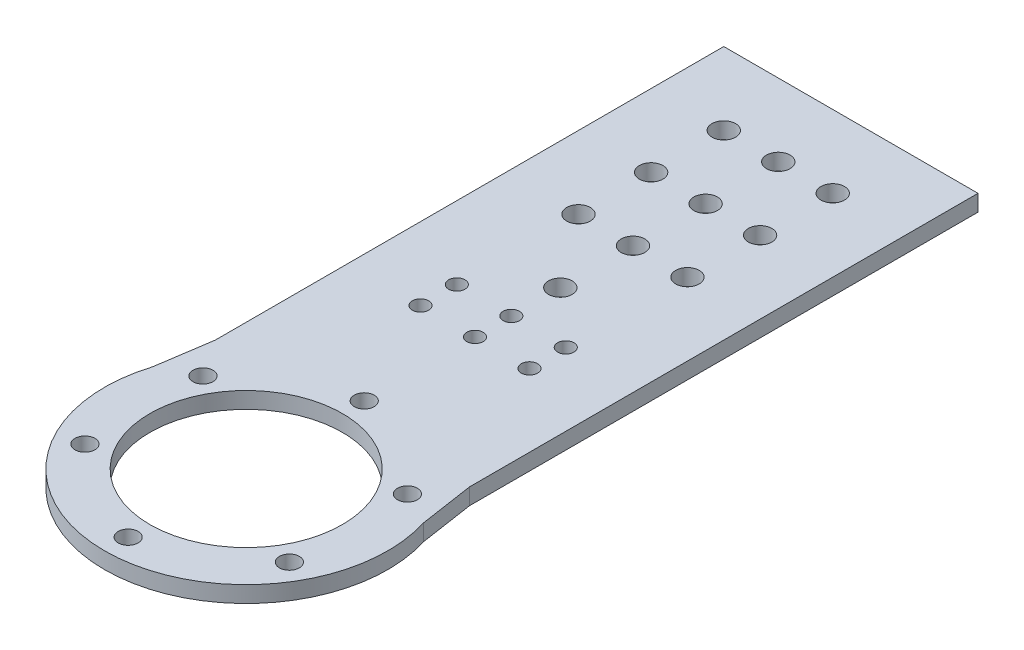
ISO-10303-21;
HEADER;
FILE_DESCRIPTION(('STEP AP214'),'2;1');
FILE_NAME('part.step','',(''),(''),'','','');
FILE_SCHEMA(('AUTOMOTIVE_DESIGN { 1 0 10303 214 1 1 1 1 }'));
ENDSEC;
DATA;
#1=APPLICATION_CONTEXT('core data for automotive mechanical design processes');
#2=APPLICATION_PROTOCOL_DEFINITION('international standard','automotive_design',2000,#1);
#3=PRODUCT_CONTEXT('',#1,'mechanical');
#4=PRODUCT('Part','Part','',(#3));
#5=PRODUCT_RELATED_PRODUCT_CATEGORY('part','',(#4));
#6=PRODUCT_DEFINITION_FORMATION('','',#4);
#7=PRODUCT_DEFINITION_CONTEXT('part definition',#1,'design');
#8=PRODUCT_DEFINITION('design','',#6,#7);
#9=PRODUCT_DEFINITION_SHAPE('','',#8);
#10=(LENGTH_UNIT() NAMED_UNIT(*) SI_UNIT(.MILLI.,.METRE.));
#11=(NAMED_UNIT(*) PLANE_ANGLE_UNIT() SI_UNIT($,.RADIAN.));
#12=(NAMED_UNIT(*) SI_UNIT($,.STERADIAN.) SOLID_ANGLE_UNIT());
#13=UNCERTAINTY_MEASURE_WITH_UNIT(LENGTH_MEASURE(1.E-05),#10,'distance_accuracy_value','');
#14=(GEOMETRIC_REPRESENTATION_CONTEXT(3) GLOBAL_UNCERTAINTY_ASSIGNED_CONTEXT((#13)) GLOBAL_UNIT_ASSIGNED_CONTEXT((#10,
#11,#12)) REPRESENTATION_CONTEXT('',''));
#15=CARTESIAN_POINT('',(0.,0.,0.));
#16=DIRECTION('',(0.,0.,1.));
#17=DIRECTION('',(1.,0.,0.));
#18=AXIS2_PLACEMENT_3D('',#15,#16,#17);
#19=CARTESIAN_POINT('',(0.,-7.75,-86.5000000000001));
#20=DIRECTION('',(0.,1.,0.));
#21=DIRECTION('',(0.,0.,1.));
#22=AXIS2_PLACEMENT_3D('',#19,#20,#21);
#23=CYLINDRICAL_SURFACE('',#22,3.25);
#24=CARTESIAN_POINT('',(0.,2.25,-86.5000000000001));
#25=DIRECTION('',(0.,1.,0.));
#26=DIRECTION('',(0.,0.,1.));
#27=AXIS2_PLACEMENT_3D('',#24,#25,#26);
#28=CIRCLE('',#27,3.25);
#29=CARTESIAN_POINT('',(0.,2.25,-83.2500000000001));
#30=VERTEX_POINT('',#29);
#31=EDGE_CURVE('E42',#30,#30,#28,.T.);
#32=ORIENTED_EDGE('',*,*,#31,.T.);
#33=EDGE_LOOP('',(#32));
#34=FACE_BOUND('',#33,.T.);
#35=CARTESIAN_POINT('',(0.,-2.25,-86.5000000000001));
#36=DIRECTION('',(0.,1.,0.));
#37=DIRECTION('',(0.,0.,1.));
#38=AXIS2_PLACEMENT_3D('',#35,#36,#37);
#39=CIRCLE('',#38,3.25);
#40=CARTESIAN_POINT('',(0.,-2.25,-83.2500000000001));
#41=VERTEX_POINT('',#40);
#42=EDGE_CURVE('E11',#41,#41,#39,.T.);
#43=ORIENTED_EDGE('',*,*,#42,.F.);
#44=EDGE_LOOP('',(#43));
#45=FACE_BOUND('',#44,.T.);
#46=ADVANCED_FACE('F35',(#34,#45),#23,.F.);
#47=CARTESIAN_POINT('',(0.,-7.75,-106.5));
#48=DIRECTION('',(0.,1.,0.));
#49=DIRECTION('',(0.,0.,1.));
#50=AXIS2_PLACEMENT_3D('',#47,#48,#49);
#51=CYLINDRICAL_SURFACE('',#50,3.25);
#52=CARTESIAN_POINT('',(0.,2.25,-106.5));
#53=DIRECTION('',(0.,1.,0.));
#54=DIRECTION('',(0.,0.,1.));
#55=AXIS2_PLACEMENT_3D('',#52,#53,#54);
#56=CIRCLE('',#55,3.25);
#57=CARTESIAN_POINT('',(0.,2.25,-103.25));
#58=VERTEX_POINT('',#57);
#59=EDGE_CURVE('E153',#58,#58,#56,.T.);
#60=ORIENTED_EDGE('',*,*,#59,.T.);
#61=EDGE_LOOP('',(#60));
#62=FACE_BOUND('',#61,.T.);
#63=CARTESIAN_POINT('',(0.,-2.25,-106.5));
#64=DIRECTION('',(0.,1.,0.));
#65=DIRECTION('',(0.,0.,1.));
#66=AXIS2_PLACEMENT_3D('',#63,#64,#65);
#67=CIRCLE('',#66,3.25);
#68=CARTESIAN_POINT('',(0.,-2.25,-103.25));
#69=VERTEX_POINT('',#68);
#70=EDGE_CURVE('E161',#69,#69,#67,.T.);
#71=ORIENTED_EDGE('',*,*,#70,.F.);
#72=EDGE_LOOP('',(#71));
#73=FACE_BOUND('',#72,.T.);
#74=ADVANCED_FACE('F186',(#62,#73),#51,.F.);
#75=CARTESIAN_POINT('',(15.,-2.25,-106.5));
#76=DIRECTION('',(0.,1.,0.));
#77=DIRECTION('',(0.,0.,1.));
#78=AXIS2_PLACEMENT_3D('',#75,#76,#77);
#79=CYLINDRICAL_SURFACE('',#78,3.25);
#80=CARTESIAN_POINT('',(15.,2.25,-106.5));
#81=DIRECTION('',(0.,1.,0.));
#82=DIRECTION('',(0.,0.,1.));
#83=AXIS2_PLACEMENT_3D('',#80,#81,#82);
#84=CIRCLE('',#83,3.25);
#85=CARTESIAN_POINT('',(15.,2.25,-103.25));
#86=VERTEX_POINT('',#85);
#87=EDGE_CURVE('E147',#86,#86,#84,.T.);
#88=ORIENTED_EDGE('',*,*,#87,.T.);
#89=EDGE_LOOP('',(#88));
#90=FACE_BOUND('',#89,.T.);
#91=CARTESIAN_POINT('',(15.,-2.25,-106.5));
#92=DIRECTION('',(0.,1.,0.));
#93=DIRECTION('',(0.,0.,1.));
#94=AXIS2_PLACEMENT_3D('',#91,#92,#93);
#95=CIRCLE('',#94,3.25);
#96=CARTESIAN_POINT('',(15.,-2.25,-103.25));
#97=VERTEX_POINT('',#96);
#98=EDGE_CURVE('E150',#97,#97,#95,.T.);
#99=ORIENTED_EDGE('',*,*,#98,.F.);
#100=EDGE_LOOP('',(#99));
#101=FACE_BOUND('',#100,.T.);
#102=ADVANCED_FACE('F190',(#90,#101),#79,.F.);
#103=CARTESIAN_POINT('',(-15.,-2.25,-106.5));
#104=DIRECTION('',(0.,1.,0.));
#105=DIRECTION('',(0.,0.,1.));
#106=AXIS2_PLACEMENT_3D('',#103,#104,#105);
#107=CYLINDRICAL_SURFACE('',#106,3.25);
#108=CARTESIAN_POINT('',(-15.,2.25,-106.5));
#109=DIRECTION('',(0.,1.,0.));
#110=DIRECTION('',(0.,0.,1.));
#111=AXIS2_PLACEMENT_3D('',#108,#109,#110);
#112=CIRCLE('',#111,3.25);
#113=CARTESIAN_POINT('',(-15.,2.25,-103.25));
#114=VERTEX_POINT('',#113);
#115=EDGE_CURVE('E141',#114,#114,#112,.T.);
#116=ORIENTED_EDGE('',*,*,#115,.T.);
#117=EDGE_LOOP('',(#116));
#118=FACE_BOUND('',#117,.T.);
#119=CARTESIAN_POINT('',(-15.,-2.25,-106.5));
#120=DIRECTION('',(0.,1.,0.));
#121=DIRECTION('',(0.,0.,1.));
#122=AXIS2_PLACEMENT_3D('',#119,#120,#121);
#123=CIRCLE('',#122,3.25);
#124=CARTESIAN_POINT('',(-15.,-2.25,-103.25));
#125=VERTEX_POINT('',#124);
#126=EDGE_CURVE('E144',#125,#125,#123,.T.);
#127=ORIENTED_EDGE('',*,*,#126,.F.);
#128=EDGE_LOOP('',(#127));
#129=FACE_BOUND('',#128,.T.);
#130=ADVANCED_FACE('F195',(#118,#129),#107,.F.);
#131=CARTESIAN_POINT('',(15.,-2.25,-63.));
#132=DIRECTION('',(0.,1.,0.));
#133=DIRECTION('',(0.,0.,1.));
#134=AXIS2_PLACEMENT_3D('',#131,#132,#133);
#135=CYLINDRICAL_SURFACE('',#134,2.25);
#136=CARTESIAN_POINT('',(15.,2.25,-63.));
#137=DIRECTION('',(0.,1.,0.));
#138=DIRECTION('',(0.,0.,1.));
#139=AXIS2_PLACEMENT_3D('',#136,#137,#138);
#140=CIRCLE('',#139,2.25);
#141=CARTESIAN_POINT('',(15.,2.25,-60.75));
#142=VERTEX_POINT('',#141);
#143=EDGE_CURVE('E135',#142,#142,#140,.T.);
#144=ORIENTED_EDGE('',*,*,#143,.T.);
#145=EDGE_LOOP('',(#144));
#146=FACE_BOUND('',#145,.T.);
#147=CARTESIAN_POINT('',(15.,-2.25,-63.));
#148=DIRECTION('',(0.,1.,0.));
#149=DIRECTION('',(0.,0.,1.));
#150=AXIS2_PLACEMENT_3D('',#147,#148,#149);
#151=CIRCLE('',#150,2.25);
#152=CARTESIAN_POINT('',(15.,-2.25,-60.75));
#153=VERTEX_POINT('',#152);
#154=EDGE_CURVE('E138',#153,#153,#151,.T.);
#155=ORIENTED_EDGE('',*,*,#154,.F.);
#156=EDGE_LOOP('',(#155));
#157=FACE_BOUND('',#156,.T.);
#158=ADVANCED_FACE('F202',(#146,#157),#135,.F.);
#159=CARTESIAN_POINT('',(0.,-2.25,-63.));
#160=DIRECTION('',(0.,1.,0.));
#161=DIRECTION('',(0.,0.,1.));
#162=AXIS2_PLACEMENT_3D('',#159,#160,#161);
#163=CYLINDRICAL_SURFACE('',#162,2.25);
#164=CARTESIAN_POINT('',(0.,2.25,-63.));
#165=DIRECTION('',(0.,1.,0.));
#166=DIRECTION('',(0.,0.,1.));
#167=AXIS2_PLACEMENT_3D('',#164,#165,#166);
#168=CIRCLE('',#167,2.25);
#169=CARTESIAN_POINT('',(0.,2.25,-60.75));
#170=VERTEX_POINT('',#169);
#171=EDGE_CURVE('E128',#170,#170,#168,.T.);
#172=ORIENTED_EDGE('',*,*,#171,.T.);
#173=EDGE_LOOP('',(#172));
#174=FACE_BOUND('',#173,.T.);
#175=CARTESIAN_POINT('',(0.,-2.25,-63.));
#176=DIRECTION('',(0.,1.,0.));
#177=DIRECTION('',(0.,0.,1.));
#178=AXIS2_PLACEMENT_3D('',#175,#176,#177);
#179=CIRCLE('',#178,2.25);
#180=CARTESIAN_POINT('',(0.,-2.25,-60.75));
#181=VERTEX_POINT('',#180);
#182=EDGE_CURVE('E132',#181,#181,#179,.T.);
#183=ORIENTED_EDGE('',*,*,#182,.F.);
#184=EDGE_LOOP('',(#183));
#185=FACE_BOUND('',#184,.T.);
#186=ADVANCED_FACE('F180',(#174,#185),#163,.F.);
#187=CARTESIAN_POINT('',(0.,2.25,0.));
#188=DIRECTION('',(0.,-1.,0.));
#189=DIRECTION('',(0.,0.,-1.));
#190=AXIS2_PLACEMENT_3D('',#187,#188,#189);
#191=CYLINDRICAL_SURFACE('',#190,39.);
#192=DIRECTION('',(0.,-1.,0.));
#193=VECTOR('',#192,1.);
#194=CARTESIAN_POINT('',(37.262443438914,2.25,-11.5113122171946));
#195=LINE('',#194,#193);
#196=CARTESIAN_POINT('',(37.2624434389141,2.25,-11.5113122171945));
#197=VERTEX_POINT('',#196);
#198=CARTESIAN_POINT('',(37.2624434389141,-2.25,-11.5113122171945));
#199=VERTEX_POINT('',#198);
#200=EDGE_CURVE('E110',#197,#199,#195,.T.);
#201=ORIENTED_EDGE('',*,*,#200,.F.);
#202=CARTESIAN_POINT('',(0.,2.25,0.));
#203=DIRECTION('',(0.,1.,0.));
#204=DIRECTION('',(0.,0.,1.));
#205=AXIS2_PLACEMENT_3D('',#202,#203,#204);
#206=CIRCLE('',#205,39.);
#207=CARTESIAN_POINT('',(-37.262443438914,2.25,-11.5113122171946));
#208=VERTEX_POINT('',#207);
#209=EDGE_CURVE('E49',#208,#197,#206,.T.);
#210=ORIENTED_EDGE('',*,*,#209,.F.);
#211=DIRECTION('',(0.,-1.,0.));
#212=VECTOR('',#211,1.);
#213=CARTESIAN_POINT('',(-37.262443438914,2.25,-11.5113122171946));
#214=LINE('',#213,#212);
#215=CARTESIAN_POINT('',(-37.262443438914,-2.25,-11.5113122171946));
#216=VERTEX_POINT('',#215);
#217=EDGE_CURVE('E113',#216,#208,#214,.F.);
#218=ORIENTED_EDGE('',*,*,#217,.F.);
#219=CARTESIAN_POINT('',(0.,-2.25,0.));
#220=DIRECTION('',(0.,1.,0.));
#221=DIRECTION('',(0.,0.,1.));
#222=AXIS2_PLACEMENT_3D('',#219,#220,#221);
#223=CIRCLE('',#222,39.);
#224=EDGE_CURVE('E124',#216,#199,#223,.T.);
#225=ORIENTED_EDGE('',*,*,#224,.T.);
#226=EDGE_LOOP('',(#201,#210,#218,#225));
#227=FACE_BOUND('',#226,.T.);
#228=ADVANCED_FACE('F170',(#227),#191,.T.);
#229=CARTESIAN_POINT('',(0.,2.25,0.));
#230=DIRECTION('',(0.,1.,0.));
#231=DIRECTION('',(0.,0.,1.));
#232=AXIS2_PLACEMENT_3D('',#229,#230,#231);
#233=PLANE('',#232);
#234=CARTESIAN_POINT('',(0.,2.25,-126.5));
#235=DIRECTION('',(0.,1.,0.));
#236=DIRECTION('',(0.,0.,1.));
#237=AXIS2_PLACEMENT_3D('',#234,#235,#236);
#238=CIRCLE('',#237,3.25);
#239=CARTESIAN_POINT('',(0.,2.25,-123.25));
#240=VERTEX_POINT('',#239);
#241=EDGE_CURVE('E509',#240,#240,#238,.T.);
#242=ORIENTED_EDGE('',*,*,#241,.F.);
#243=EDGE_LOOP('',(#242));
#244=FACE_BOUND('',#243,.T.);
#245=CARTESIAN_POINT('',(0.,2.25,-146.5));
#246=DIRECTION('',(0.,1.,0.));
#247=DIRECTION('',(0.,0.,1.));
#248=AXIS2_PLACEMENT_3D('',#245,#246,#247);
#249=CIRCLE('',#248,3.25);
#250=CARTESIAN_POINT('',(0.,2.25,-143.25));
#251=VERTEX_POINT('',#250);
#252=EDGE_CURVE('E158',#251,#251,#249,.T.);
#253=ORIENTED_EDGE('',*,*,#252,.F.);
#254=EDGE_LOOP('',(#253));
#255=FACE_BOUND('',#254,.T.);
#256=CARTESIAN_POINT('',(15.,2.25,-126.5));
#257=DIRECTION('',(0.,1.,0.));
#258=DIRECTION('',(0.,0.,1.));
#259=AXIS2_PLACEMENT_3D('',#256,#257,#258);
#260=CIRCLE('',#259,3.25);
#261=CARTESIAN_POINT('',(15.,2.25,-123.25));
#262=VERTEX_POINT('',#261);
#263=EDGE_CURVE('E157',#262,#262,#260,.T.);
#264=ORIENTED_EDGE('',*,*,#263,.F.);
#265=EDGE_LOOP('',(#264));
#266=FACE_BOUND('',#265,.T.);
#267=CARTESIAN_POINT('',(-15.,2.25,-126.5));
#268=DIRECTION('',(0.,1.,0.));
#269=DIRECTION('',(0.,0.,1.));
#270=AXIS2_PLACEMENT_3D('',#267,#268,#269);
#271=CIRCLE('',#270,3.25);
#272=CARTESIAN_POINT('',(-15.,2.25,-123.25));
#273=VERTEX_POINT('',#272);
#274=EDGE_CURVE('E523',#273,#273,#271,.T.);
#275=ORIENTED_EDGE('',*,*,#274,.F.);
#276=EDGE_LOOP('',(#275));
#277=FACE_BOUND('',#276,.T.);
#278=CARTESIAN_POINT('',(-15.,2.25,-146.5));
#279=DIRECTION('',(0.,1.,0.));
#280=DIRECTION('',(0.,0.,1.));
#281=AXIS2_PLACEMENT_3D('',#278,#279,#280);
#282=CIRCLE('',#281,3.25);
#283=CARTESIAN_POINT('',(-15.,2.25,-143.25));
#284=VERTEX_POINT('',#283);
#285=EDGE_CURVE('E538',#284,#284,#282,.T.);
#286=ORIENTED_EDGE('',*,*,#285,.F.);
#287=EDGE_LOOP('',(#286));
#288=FACE_BOUND('',#287,.T.);
#289=CARTESIAN_POINT('',(15.,2.25,-146.5));
#290=DIRECTION('',(0.,1.,0.));
#291=DIRECTION('',(0.,0.,1.));
#292=AXIS2_PLACEMENT_3D('',#289,#290,#291);
#293=CIRCLE('',#292,3.25);
#294=CARTESIAN_POINT('',(15.,2.25,-143.25));
#295=VERTEX_POINT('',#294);
#296=EDGE_CURVE('E533',#295,#295,#293,.T.);
#297=ORIENTED_EDGE('',*,*,#296,.F.);
#298=EDGE_LOOP('',(#297));
#299=FACE_BOUND('',#298,.T.);
#300=CARTESIAN_POINT('',(-15.,2.25,-73.));
#301=DIRECTION('',(0.,1.,0.));
#302=DIRECTION('',(0.,0.,1.));
#303=AXIS2_PLACEMENT_3D('',#300,#301,#302);
#304=CIRCLE('',#303,2.25);
#305=CARTESIAN_POINT('',(-15.,2.25,-70.75));
#306=VERTEX_POINT('',#305);
#307=EDGE_CURVE('E550',#306,#306,#304,.T.);
#308=ORIENTED_EDGE('',*,*,#307,.F.);
#309=EDGE_LOOP('',(#308));
#310=FACE_BOUND('',#309,.T.);
#311=CARTESIAN_POINT('',(-15.,2.25,-63.));
#312=DIRECTION('',(0.,1.,0.));
#313=DIRECTION('',(0.,0.,1.));
#314=AXIS2_PLACEMENT_3D('',#311,#312,#313);
#315=CIRCLE('',#314,2.25);
#316=CARTESIAN_POINT('',(-15.,2.25,-60.75));
#317=VERTEX_POINT('',#316);
#318=EDGE_CURVE('E545',#317,#317,#315,.T.);
#319=ORIENTED_EDGE('',*,*,#318,.F.);
#320=EDGE_LOOP('',(#319));
#321=FACE_BOUND('',#320,.T.);
#322=CARTESIAN_POINT('',(15.,2.25,-73.));
#323=DIRECTION('',(0.,1.,0.));
#324=DIRECTION('',(0.,0.,1.));
#325=AXIS2_PLACEMENT_3D('',#322,#323,#324);
#326=CIRCLE('',#325,2.25);
#327=CARTESIAN_POINT('',(15.,2.25,-70.75));
#328=VERTEX_POINT('',#327);
#329=EDGE_CURVE('E553',#328,#328,#326,.T.);
#330=ORIENTED_EDGE('',*,*,#329,.F.);
#331=EDGE_LOOP('',(#330));
#332=FACE_BOUND('',#331,.T.);
#333=CARTESIAN_POINT('',(0.,2.25,-73.));
#334=DIRECTION('',(0.,1.,0.));
#335=DIRECTION('',(0.,0.,1.));
#336=AXIS2_PLACEMENT_3D('',#333,#334,#335);
#337=CIRCLE('',#336,2.25);
#338=CARTESIAN_POINT('',(0.,2.25,-70.75));
#339=VERTEX_POINT('',#338);
#340=EDGE_CURVE('E562',#339,#339,#337,.T.);
#341=ORIENTED_EDGE('',*,*,#340,.F.);
#342=EDGE_LOOP('',(#341));
#343=FACE_BOUND('',#342,.T.);
#344=CARTESIAN_POINT('',(28.1458256229941,2.25,-16.2500000000003));
#345=DIRECTION('',(0.,1.,0.));
#346=DIRECTION('',(-0.866025403784433,0.,0.50000000000001));
#347=AXIS2_PLACEMENT_3D('',#344,#345,#346);
#348=CIRCLE('',#347,2.75);
#349=CARTESIAN_POINT('',(25.7642557625869,2.25,-14.8750000000003));
#350=VERTEX_POINT('',#349);
#351=EDGE_CURVE('E565',#350,#350,#348,.T.);
#352=ORIENTED_EDGE('',*,*,#351,.F.);
#353=EDGE_LOOP('',(#352));
#354=FACE_BOUND('',#353,.T.);
#355=CARTESIAN_POINT('',(28.1458256229944,2.25,16.2499999999997));
#356=DIRECTION('',(0.,1.,0.));
#357=DIRECTION('',(-0.866025403784443,0.,-0.499999999999992));
#358=AXIS2_PLACEMENT_3D('',#355,#356,#357);
#359=CIRCLE('',#358,2.75);
#360=CARTESIAN_POINT('',(25.7642557625872,2.25,14.8749999999998));
#361=VERTEX_POINT('',#360);
#362=EDGE_CURVE('E580',#361,#361,#359,.T.);
#363=ORIENTED_EDGE('',*,*,#362,.F.);
#364=EDGE_LOOP('',(#363));
#365=FACE_BOUND('',#364,.T.);
#366=CARTESIAN_POINT('',(0.,2.25,32.5));
#367=DIRECTION('',(0.,1.,0.));
#368=DIRECTION('',(0.,0.,-1.));
#369=AXIS2_PLACEMENT_3D('',#366,#367,#368);
#370=CIRCLE('',#369,2.75);
#371=CARTESIAN_POINT('',(0.,2.25,29.75));
#372=VERTEX_POINT('',#371);
#373=EDGE_CURVE('E574',#372,#372,#370,.T.);
#374=ORIENTED_EDGE('',*,*,#373,.F.);
#375=EDGE_LOOP('',(#374));
#376=FACE_BOUND('',#375,.T.);
#377=CARTESIAN_POINT('',(-28.1458256229942,2.25,16.2500000000001));
#378=DIRECTION('',(0.,1.,0.));
#379=DIRECTION('',(0.866025403784436,0.,-0.500000000000004));
#380=AXIS2_PLACEMENT_3D('',#377,#378,#379);
#381=CIRCLE('',#380,2.75);
#382=CARTESIAN_POINT('',(-25.764255762587,2.25,14.8750000000001));
#383=VERTEX_POINT('',#382);
#384=EDGE_CURVE('E566',#383,#383,#381,.T.);
#385=ORIENTED_EDGE('',*,*,#384,.F.);
#386=EDGE_LOOP('',(#385));
#387=FACE_BOUND('',#386,.T.);
#388=CARTESIAN_POINT('',(-28.1458256229943,2.25,-16.2499999999999));
#389=DIRECTION('',(0.,1.,0.));
#390=DIRECTION('',(0.86602540378444,0.,0.499999999999998));
#391=AXIS2_PLACEMENT_3D('',#388,#389,#390);
#392=CIRCLE('',#391,2.75);
#393=CARTESIAN_POINT('',(-25.7642557625871,2.25,-14.8749999999999));
#394=VERTEX_POINT('',#393);
#395=EDGE_CURVE('E573',#394,#394,#392,.T.);
#396=ORIENTED_EDGE('',*,*,#395,.F.);
#397=EDGE_LOOP('',(#396));
#398=FACE_BOUND('',#397,.T.);
#399=CARTESIAN_POINT('',(0.,2.25,-32.5));
#400=DIRECTION('',(0.,1.,0.));
#401=DIRECTION('',(0.,0.,1.));
#402=AXIS2_PLACEMENT_3D('',#399,#400,#401);
#403=CIRCLE('',#402,2.75);
#404=CARTESIAN_POINT('',(0.,2.25,-29.75));
#405=VERTEX_POINT('',#404);
#406=EDGE_CURVE('E595',#405,#405,#403,.T.);
#407=ORIENTED_EDGE('',*,*,#406,.F.);
#408=EDGE_LOOP('',(#407));
#409=FACE_BOUND('',#408,.T.);
#410=DIRECTION('',(-0.149252692330049,0.,0.988799086686588));
#411=VECTOR('',#410,1.);
#412=CARTESIAN_POINT('',(-35.,2.25,-26.5));
#413=LINE('',#412,#411);
#414=CARTESIAN_POINT('',(-35.,2.25,-26.5));
#415=VERTEX_POINT('',#414);
#416=EDGE_CURVE('E94',#415,#208,#413,.T.);
#417=ORIENTED_EDGE('',*,*,#416,.T.);
#418=ORIENTED_EDGE('',*,*,#209,.T.);
#419=DIRECTION('',(-0.149252692330051,0.,-0.988799086686588));
#420=VECTOR('',#419,1.);
#421=CARTESIAN_POINT('',(35.,2.25,-26.5));
#422=LINE('',#421,#420);
#423=CARTESIAN_POINT('',(35.,2.25,-26.5));
#424=VERTEX_POINT('',#423);
#425=EDGE_CURVE('E602',#197,#424,#422,.T.);
#426=ORIENTED_EDGE('',*,*,#425,.T.);
#427=DIRECTION('',(0.,0.,-1.));
#428=VECTOR('',#427,1.);
#429=CARTESIAN_POINT('',(35.,2.25,-166.5));
#430=LINE('',#429,#428);
#431=CARTESIAN_POINT('',(35.,2.25,-166.5));
#432=VERTEX_POINT('',#431);
#433=EDGE_CURVE('E101',#424,#432,#430,.T.);
#434=ORIENTED_EDGE('',*,*,#433,.T.);
#435=DIRECTION('',(-1.,0.,0.));
#436=VECTOR('',#435,1.);
#437=CARTESIAN_POINT('',(-35.,2.25,-166.5));
#438=LINE('',#437,#436);
#439=CARTESIAN_POINT('',(-35.,2.25,-166.5));
#440=VERTEX_POINT('',#439);
#441=EDGE_CURVE('E95',#432,#440,#438,.T.);
#442=ORIENTED_EDGE('',*,*,#441,.T.);
#443=DIRECTION('',(0.,0.,1.));
#444=VECTOR('',#443,1.);
#445=CARTESIAN_POINT('',(-35.,2.25,-166.5));
#446=LINE('',#445,#444);
#447=EDGE_CURVE('E85',#440,#415,#446,.T.);
#448=ORIENTED_EDGE('',*,*,#447,.T.);
#449=EDGE_LOOP('',(#417,#418,#426,#434,#442,#448));
#450=FACE_BOUND('',#449,.T.);
#451=CARTESIAN_POINT('',(0.,2.25,0.));
#452=DIRECTION('',(0.,1.,0.));
#453=DIRECTION('',(0.,0.,1.));
#454=AXIS2_PLACEMENT_3D('',#451,#452,#453);
#455=CIRCLE('',#454,26.5);
#456=CARTESIAN_POINT('',(0.,2.25,26.5));
#457=VERTEX_POINT('',#456);
#458=EDGE_CURVE('E121',#457,#457,#455,.T.);
#459=ORIENTED_EDGE('',*,*,#458,.F.);
#460=EDGE_LOOP('',(#459));
#461=FACE_BOUND('',#460,.T.);
#462=ORIENTED_EDGE('',*,*,#171,.F.);
#463=EDGE_LOOP('',(#462));
#464=FACE_BOUND('',#463,.T.);
#465=ORIENTED_EDGE('',*,*,#143,.F.);
#466=EDGE_LOOP('',(#465));
#467=FACE_BOUND('',#466,.T.);
#468=ORIENTED_EDGE('',*,*,#115,.F.);
#469=EDGE_LOOP('',(#468));
#470=FACE_BOUND('',#469,.T.);
#471=ORIENTED_EDGE('',*,*,#87,.F.);
#472=EDGE_LOOP('',(#471));
#473=FACE_BOUND('',#472,.T.);
#474=ORIENTED_EDGE('',*,*,#59,.F.);
#475=EDGE_LOOP('',(#474));
#476=FACE_BOUND('',#475,.T.);
#477=ORIENTED_EDGE('',*,*,#31,.F.);
#478=EDGE_LOOP('',(#477));
#479=FACE_BOUND('',#478,.T.);
#480=ADVANCED_FACE('F98',(#244,#255,#266,#277,#288,#299,#310,#321,#332,#343,#354,#365,#376,#387,
#398,#409,#450,#461,#464,#467,#470,#473,#476,#479),#233,.T.);
#481=CARTESIAN_POINT('',(0.,-2.25,0.));
#482=DIRECTION('',(0.,1.,0.));
#483=DIRECTION('',(0.,0.,1.));
#484=AXIS2_PLACEMENT_3D('',#481,#482,#483);
#485=PLANE('',#484);
#486=CARTESIAN_POINT('',(0.,-2.25,-126.5));
#487=DIRECTION('',(0.,1.,0.));
#488=DIRECTION('',(0.,0.,1.));
#489=AXIS2_PLACEMENT_3D('',#486,#487,#488);
#490=CIRCLE('',#489,3.25);
#491=CARTESIAN_POINT('',(0.,-2.25,-123.25));
#492=VERTEX_POINT('',#491);
#493=EDGE_CURVE('E512',#492,#492,#490,.T.);
#494=ORIENTED_EDGE('',*,*,#493,.T.);
#495=EDGE_LOOP('',(#494));
#496=FACE_BOUND('',#495,.T.);
#497=CARTESIAN_POINT('',(0.,-2.25,-146.5));
#498=DIRECTION('',(0.,1.,0.));
#499=DIRECTION('',(0.,0.,1.));
#500=AXIS2_PLACEMENT_3D('',#497,#498,#499);
#501=CIRCLE('',#500,3.25);
#502=CARTESIAN_POINT('',(0.,-2.25,-143.25));
#503=VERTEX_POINT('',#502);
#504=EDGE_CURVE('E154',#503,#503,#501,.T.);
#505=ORIENTED_EDGE('',*,*,#504,.T.);
#506=EDGE_LOOP('',(#505));
#507=FACE_BOUND('',#506,.T.);
#508=CARTESIAN_POINT('',(15.,-2.25,-126.5));
#509=DIRECTION('',(0.,1.,0.));
#510=DIRECTION('',(0.,0.,1.));
#511=AXIS2_PLACEMENT_3D('',#508,#509,#510);
#512=CIRCLE('',#511,3.25);
#513=CARTESIAN_POINT('',(15.,-2.25,-123.25));
#514=VERTEX_POINT('',#513);
#515=EDGE_CURVE('E520',#514,#514,#512,.T.);
#516=ORIENTED_EDGE('',*,*,#515,.T.);
#517=EDGE_LOOP('',(#516));
#518=FACE_BOUND('',#517,.T.);
#519=CARTESIAN_POINT('',(-15.,-2.25,-126.5));
#520=DIRECTION('',(0.,1.,0.));
#521=DIRECTION('',(0.,0.,1.));
#522=AXIS2_PLACEMENT_3D('',#519,#520,#521);
#523=CIRCLE('',#522,3.25);
#524=CARTESIAN_POINT('',(-15.,-2.25,-123.25));
#525=VERTEX_POINT('',#524);
#526=EDGE_CURVE('E526',#525,#525,#523,.T.);
#527=ORIENTED_EDGE('',*,*,#526,.T.);
#528=EDGE_LOOP('',(#527));
#529=FACE_BOUND('',#528,.T.);
#530=CARTESIAN_POINT('',(-15.,-2.25,-146.5));
#531=DIRECTION('',(0.,1.,0.));
#532=DIRECTION('',(0.,0.,1.));
#533=AXIS2_PLACEMENT_3D('',#530,#531,#532);
#534=CIRCLE('',#533,3.25);
#535=CARTESIAN_POINT('',(-15.,-2.25,-143.25));
#536=VERTEX_POINT('',#535);
#537=EDGE_CURVE('E530',#536,#536,#534,.T.);
#538=ORIENTED_EDGE('',*,*,#537,.T.);
#539=EDGE_LOOP('',(#538));
#540=FACE_BOUND('',#539,.T.);
#541=CARTESIAN_POINT('',(15.,-2.25,-146.5));
#542=DIRECTION('',(0.,1.,0.));
#543=DIRECTION('',(0.,0.,1.));
#544=AXIS2_PLACEMENT_3D('',#541,#542,#543);
#545=CIRCLE('',#544,3.25);
#546=CARTESIAN_POINT('',(15.,-2.25,-143.25));
#547=VERTEX_POINT('',#546);
#548=EDGE_CURVE('E529',#547,#547,#545,.T.);
#549=ORIENTED_EDGE('',*,*,#548,.T.);
#550=EDGE_LOOP('',(#549));
#551=FACE_BOUND('',#550,.T.);
#552=CARTESIAN_POINT('',(-15.,-2.25,-73.));
#553=DIRECTION('',(0.,1.,0.));
#554=DIRECTION('',(0.,0.,1.));
#555=AXIS2_PLACEMENT_3D('',#552,#553,#554);
#556=CIRCLE('',#555,2.25);
#557=CARTESIAN_POINT('',(-15.,-2.25,-70.75));
#558=VERTEX_POINT('',#557);
#559=EDGE_CURVE('E542',#558,#558,#556,.T.);
#560=ORIENTED_EDGE('',*,*,#559,.T.);
#561=EDGE_LOOP('',(#560));
#562=FACE_BOUND('',#561,.T.);
#563=CARTESIAN_POINT('',(-15.,-2.25,-63.));
#564=DIRECTION('',(0.,1.,0.));
#565=DIRECTION('',(0.,0.,1.));
#566=AXIS2_PLACEMENT_3D('',#563,#564,#565);
#567=CIRCLE('',#566,2.25);
#568=CARTESIAN_POINT('',(-15.,-2.25,-60.75));
#569=VERTEX_POINT('',#568);
#570=EDGE_CURVE('E541',#569,#569,#567,.T.);
#571=ORIENTED_EDGE('',*,*,#570,.T.);
#572=EDGE_LOOP('',(#571));
#573=FACE_BOUND('',#572,.T.);
#574=CARTESIAN_POINT('',(15.,-2.25,-73.));
#575=DIRECTION('',(0.,1.,0.));
#576=DIRECTION('',(0.,0.,1.));
#577=AXIS2_PLACEMENT_3D('',#574,#575,#576);
#578=CIRCLE('',#577,2.25);
#579=CARTESIAN_POINT('',(15.,-2.25,-70.75));
#580=VERTEX_POINT('',#579);
#581=EDGE_CURVE('E556',#580,#580,#578,.T.);
#582=ORIENTED_EDGE('',*,*,#581,.T.);
#583=EDGE_LOOP('',(#582));
#584=FACE_BOUND('',#583,.T.);
#585=CARTESIAN_POINT('',(0.,-2.25,-73.));
#586=DIRECTION('',(0.,1.,0.));
#587=DIRECTION('',(0.,0.,1.));
#588=AXIS2_PLACEMENT_3D('',#585,#586,#587);
#589=CIRCLE('',#588,2.25);
#590=CARTESIAN_POINT('',(0.,-2.25,-70.75));
#591=VERTEX_POINT('',#590);
#592=EDGE_CURVE('E559',#591,#591,#589,.T.);
#593=ORIENTED_EDGE('',*,*,#592,.T.);
#594=EDGE_LOOP('',(#593));
#595=FACE_BOUND('',#594,.T.);
#596=CARTESIAN_POINT('',(28.1458256229941,-2.25,-16.2500000000003));
#597=DIRECTION('',(0.,1.,0.));
#598=DIRECTION('',(-0.866025403784433,0.,0.50000000000001));
#599=AXIS2_PLACEMENT_3D('',#596,#597,#598);
#600=CIRCLE('',#599,2.75);
#601=CARTESIAN_POINT('',(25.7642557625869,-2.25,-14.8750000000003));
#602=VERTEX_POINT('',#601);
#603=EDGE_CURVE('E583',#602,#602,#600,.T.);
#604=ORIENTED_EDGE('',*,*,#603,.T.);
#605=EDGE_LOOP('',(#604));
#606=FACE_BOUND('',#605,.T.);
#607=CARTESIAN_POINT('',(28.1458256229944,-2.25,16.2499999999997));
#608=DIRECTION('',(0.,1.,0.));
#609=DIRECTION('',(-0.866025403784443,0.,-0.499999999999992));
#610=AXIS2_PLACEMENT_3D('',#607,#608,#609);
#611=CIRCLE('',#610,2.75);
#612=CARTESIAN_POINT('',(25.7642557625872,-2.25,14.8749999999998));
#613=VERTEX_POINT('',#612);
#614=EDGE_CURVE('E577',#613,#613,#611,.T.);
#615=ORIENTED_EDGE('',*,*,#614,.T.);
#616=EDGE_LOOP('',(#615));
#617=FACE_BOUND('',#616,.T.);
#618=CARTESIAN_POINT('',(0.,-2.25,32.5));
#619=DIRECTION('',(0.,1.,0.));
#620=DIRECTION('',(0.,0.,-1.));
#621=AXIS2_PLACEMENT_3D('',#618,#619,#620);
#622=CIRCLE('',#621,2.75);
#623=CARTESIAN_POINT('',(0.,-2.25,29.75));
#624=VERTEX_POINT('',#623);
#625=EDGE_CURVE('E570',#624,#624,#622,.T.);
#626=ORIENTED_EDGE('',*,*,#625,.T.);
#627=EDGE_LOOP('',(#626));
#628=FACE_BOUND('',#627,.T.);
#629=CARTESIAN_POINT('',(-28.1458256229942,-2.25,16.2500000000001));
#630=DIRECTION('',(0.,1.,0.));
#631=DIRECTION('',(0.866025403784436,0.,-0.500000000000004));
#632=AXIS2_PLACEMENT_3D('',#629,#630,#631);
#633=CIRCLE('',#632,2.75);
#634=CARTESIAN_POINT('',(-25.764255762587,-2.25,14.8750000000001));
#635=VERTEX_POINT('',#634);
#636=EDGE_CURVE('E569',#635,#635,#633,.T.);
#637=ORIENTED_EDGE('',*,*,#636,.T.);
#638=EDGE_LOOP('',(#637));
#639=FACE_BOUND('',#638,.T.);
#640=CARTESIAN_POINT('',(-28.1458256229943,-2.25,-16.2499999999999));
#641=DIRECTION('',(0.,1.,0.));
#642=DIRECTION('',(0.86602540378444,0.,0.499999999999998));
#643=AXIS2_PLACEMENT_3D('',#640,#641,#642);
#644=CIRCLE('',#643,2.75);
#645=CARTESIAN_POINT('',(-25.7642557625871,-2.25,-14.8749999999999));
#646=VERTEX_POINT('',#645);
#647=EDGE_CURVE('E592',#646,#646,#644,.T.);
#648=ORIENTED_EDGE('',*,*,#647,.T.);
#649=EDGE_LOOP('',(#648));
#650=FACE_BOUND('',#649,.T.);
#651=CARTESIAN_POINT('',(0.,-2.25,-32.5));
#652=DIRECTION('',(0.,1.,0.));
#653=DIRECTION('',(0.,0.,1.));
#654=AXIS2_PLACEMENT_3D('',#651,#652,#653);
#655=CIRCLE('',#654,2.75);
#656=CARTESIAN_POINT('',(0.,-2.25,-29.75));
#657=VERTEX_POINT('',#656);
#658=EDGE_CURVE('E598',#657,#657,#655,.T.);
#659=ORIENTED_EDGE('',*,*,#658,.T.);
#660=EDGE_LOOP('',(#659));
#661=FACE_BOUND('',#660,.T.);
#662=ORIENTED_EDGE('',*,*,#224,.F.);
#663=DIRECTION('',(-0.149252692330049,0.,0.988799086686588));
#664=VECTOR('',#663,1.);
#665=CARTESIAN_POINT('',(-35.,-2.25,-26.5));
#666=LINE('',#665,#664);
#667=CARTESIAN_POINT('',(-35.,-2.25,-26.5));
#668=VERTEX_POINT('',#667);
#669=EDGE_CURVE('E609',#668,#216,#666,.T.);
#670=ORIENTED_EDGE('',*,*,#669,.F.);
#671=DIRECTION('',(0.,0.,1.));
#672=VECTOR('',#671,1.);
#673=CARTESIAN_POINT('',(-35.,-2.25,-166.5));
#674=LINE('',#673,#672);
#675=CARTESIAN_POINT('',(-35.,-2.25,-166.5));
#676=VERTEX_POINT('',#675);
#677=EDGE_CURVE('E607',#676,#668,#674,.T.);
#678=ORIENTED_EDGE('',*,*,#677,.F.);
#679=DIRECTION('',(-1.,0.,0.));
#680=VECTOR('',#679,1.);
#681=CARTESIAN_POINT('',(-35.,-2.25,-166.5));
#682=LINE('',#681,#680);
#683=CARTESIAN_POINT('',(35.,-2.25,-166.5));
#684=VERTEX_POINT('',#683);
#685=EDGE_CURVE('E109',#684,#676,#682,.T.);
#686=ORIENTED_EDGE('',*,*,#685,.F.);
#687=DIRECTION('',(0.,0.,-1.));
#688=VECTOR('',#687,1.);
#689=CARTESIAN_POINT('',(35.,-2.25,-166.5));
#690=LINE('',#689,#688);
#691=CARTESIAN_POINT('',(35.,-2.25,-26.5));
#692=VERTEX_POINT('',#691);
#693=EDGE_CURVE('E105',#692,#684,#690,.T.);
#694=ORIENTED_EDGE('',*,*,#693,.F.);
#695=DIRECTION('',(-0.149252692330051,0.,-0.988799086686588));
#696=VECTOR('',#695,1.);
#697=CARTESIAN_POINT('',(35.,-2.25,-26.5));
#698=LINE('',#697,#696);
#699=EDGE_CURVE('E612',#199,#692,#698,.T.);
#700=ORIENTED_EDGE('',*,*,#699,.F.);
#701=EDGE_LOOP('',(#662,#670,#678,#686,#694,#700));
#702=FACE_BOUND('',#701,.T.);
#703=CARTESIAN_POINT('',(0.,-2.25,0.));
#704=DIRECTION('',(0.,1.,0.));
#705=DIRECTION('',(0.,0.,1.));
#706=AXIS2_PLACEMENT_3D('',#703,#704,#705);
#707=CIRCLE('',#706,26.5);
#708=CARTESIAN_POINT('',(0.,-2.25,26.5));
#709=VERTEX_POINT('',#708);
#710=EDGE_CURVE('E120',#709,#709,#707,.T.);
#711=ORIENTED_EDGE('',*,*,#710,.T.);
#712=EDGE_LOOP('',(#711));
#713=FACE_BOUND('',#712,.T.);
#714=ORIENTED_EDGE('',*,*,#182,.T.);
#715=EDGE_LOOP('',(#714));
#716=FACE_BOUND('',#715,.T.);
#717=ORIENTED_EDGE('',*,*,#154,.T.);
#718=EDGE_LOOP('',(#717));
#719=FACE_BOUND('',#718,.T.);
#720=ORIENTED_EDGE('',*,*,#126,.T.);
#721=EDGE_LOOP('',(#720));
#722=FACE_BOUND('',#721,.T.);
#723=ORIENTED_EDGE('',*,*,#98,.T.);
#724=EDGE_LOOP('',(#723));
#725=FACE_BOUND('',#724,.T.);
#726=ORIENTED_EDGE('',*,*,#70,.T.);
#727=EDGE_LOOP('',(#726));
#728=FACE_BOUND('',#727,.T.);
#729=ORIENTED_EDGE('',*,*,#42,.T.);
#730=EDGE_LOOP('',(#729));
#731=FACE_BOUND('',#730,.T.);
#732=ADVANCED_FACE('F169',(#496,#507,#518,#529,#540,#551,#562,#573,#584,#595,#606,#617,#628,
#639,#650,#661,#702,#713,#716,#719,#722,#725,#728,#731),#485,.F.);
#733=CARTESIAN_POINT('',(0.,2.25,0.));
#734=DIRECTION('',(0.,-1.,0.));
#735=DIRECTION('',(0.,0.,-1.));
#736=AXIS2_PLACEMENT_3D('',#733,#734,#735);
#737=CYLINDRICAL_SURFACE('',#736,26.5);
#738=ORIENTED_EDGE('',*,*,#710,.F.);
#739=EDGE_LOOP('',(#738));
#740=FACE_BOUND('',#739,.T.);
#741=ORIENTED_EDGE('',*,*,#458,.T.);
#742=EDGE_LOOP('',(#741));
#743=FACE_BOUND('',#742,.T.);
#744=ADVANCED_FACE('F177',(#740,#743),#737,.F.);
#745=CARTESIAN_POINT('',(-35.,2.25,-26.5));
#746=DIRECTION('',(0.988799086686589,0.,0.149252692330049));
#747=DIRECTION('',(0.149252692330049,0.,-0.988799086686589));
#748=AXIS2_PLACEMENT_3D('',#745,#746,#747);
#749=PLANE('',#748);
#750=ORIENTED_EDGE('',*,*,#669,.T.);
#751=ORIENTED_EDGE('',*,*,#217,.T.);
#752=ORIENTED_EDGE('',*,*,#416,.F.);
#753=DIRECTION('',(0.,-1.,0.));
#754=VECTOR('',#753,1.);
#755=CARTESIAN_POINT('',(-35.,2.25,-26.5));
#756=LINE('',#755,#754);
#757=EDGE_CURVE('E92',#415,#668,#756,.T.);
#758=ORIENTED_EDGE('',*,*,#757,.T.);
#759=EDGE_LOOP('',(#750,#751,#752,#758));
#760=FACE_BOUND('',#759,.T.);
#761=ADVANCED_FACE('F255',(#760),#749,.F.);
#762=CARTESIAN_POINT('',(35.,2.25,-26.5));
#763=DIRECTION('',(-0.988799086686588,0.,0.149252692330051));
#764=DIRECTION('',(0.149252692330051,0.,0.988799086686588));
#765=AXIS2_PLACEMENT_3D('',#762,#763,#764);
#766=PLANE('',#765);
#767=ORIENTED_EDGE('',*,*,#425,.F.);
#768=ORIENTED_EDGE('',*,*,#200,.T.);
#769=ORIENTED_EDGE('',*,*,#699,.T.);
#770=DIRECTION('',(0.,-1.,0.));
#771=VECTOR('',#770,1.);
#772=CARTESIAN_POINT('',(35.,2.25,-26.5));
#773=LINE('',#772,#771);
#774=EDGE_CURVE('E115',#424,#692,#773,.T.);
#775=ORIENTED_EDGE('',*,*,#774,.F.);
#776=EDGE_LOOP('',(#767,#768,#769,#775));
#777=FACE_BOUND('',#776,.T.);
#778=ADVANCED_FACE('F266',(#777),#766,.F.);
#779=CARTESIAN_POINT('',(-35.,2.25,-166.5));
#780=DIRECTION('',(0.,0.,1.));
#781=DIRECTION('',(1.,0.,0.));
#782=AXIS2_PLACEMENT_3D('',#779,#780,#781);
#783=PLANE('',#782);
#784=ORIENTED_EDGE('',*,*,#685,.T.);
#785=DIRECTION('',(0.,-1.,0.));
#786=VECTOR('',#785,1.);
#787=CARTESIAN_POINT('',(-35.,2.25,-166.5));
#788=LINE('',#787,#786);
#789=EDGE_CURVE('E89',#440,#676,#788,.T.);
#790=ORIENTED_EDGE('',*,*,#789,.F.);
#791=ORIENTED_EDGE('',*,*,#441,.F.);
#792=DIRECTION('',(0.,-1.,0.));
#793=VECTOR('',#792,1.);
#794=CARTESIAN_POINT('',(35.,2.25,-166.5));
#795=LINE('',#794,#793);
#796=EDGE_CURVE('E605',#432,#684,#795,.T.);
#797=ORIENTED_EDGE('',*,*,#796,.T.);
#798=EDGE_LOOP('',(#784,#790,#791,#797));
#799=FACE_BOUND('',#798,.T.);
#800=ADVANCED_FACE('F107',(#799),#783,.F.);
#801=CARTESIAN_POINT('',(-35.,2.25,-166.5));
#802=DIRECTION('',(1.,0.,0.));
#803=DIRECTION('',(0.,0.,-1.));
#804=AXIS2_PLACEMENT_3D('',#801,#802,#803);
#805=PLANE('',#804);
#806=ORIENTED_EDGE('',*,*,#677,.T.);
#807=ORIENTED_EDGE('',*,*,#757,.F.);
#808=ORIENTED_EDGE('',*,*,#447,.F.);
#809=ORIENTED_EDGE('',*,*,#789,.T.);
#810=EDGE_LOOP('',(#806,#807,#808,#809));
#811=FACE_BOUND('',#810,.T.);
#812=ADVANCED_FACE('F87',(#811),#805,.F.);
#813=CARTESIAN_POINT('',(35.,2.25,-166.5));
#814=DIRECTION('',(-1.,0.,0.));
#815=DIRECTION('',(0.,0.,1.));
#816=AXIS2_PLACEMENT_3D('',#813,#814,#815);
#817=PLANE('',#816);
#818=ORIENTED_EDGE('',*,*,#693,.T.);
#819=ORIENTED_EDGE('',*,*,#796,.F.);
#820=ORIENTED_EDGE('',*,*,#433,.F.);
#821=ORIENTED_EDGE('',*,*,#774,.T.);
#822=EDGE_LOOP('',(#818,#819,#820,#821));
#823=FACE_BOUND('',#822,.T.);
#824=ADVANCED_FACE('F294',(#823),#817,.F.);
#825=CARTESIAN_POINT('',(0.,-2.25,-32.5));
#826=DIRECTION('',(0.,1.,0.));
#827=DIRECTION('',(0.,0.,1.));
#828=AXIS2_PLACEMENT_3D('',#825,#826,#827);
#829=CYLINDRICAL_SURFACE('',#828,2.75);
#830=ORIENTED_EDGE('',*,*,#658,.F.);
#831=EDGE_LOOP('',(#830));
#832=FACE_BOUND('',#831,.T.);
#833=ORIENTED_EDGE('',*,*,#406,.T.);
#834=EDGE_LOOP('',(#833));
#835=FACE_BOUND('',#834,.T.);
#836=ADVANCED_FACE('F303',(#832,#835),#829,.F.);
#837=CARTESIAN_POINT('',(-28.1458256229943,-2.25,-16.2499999999999));
#838=DIRECTION('',(0.,1.,0.));
#839=DIRECTION('',(0.,0.,1.));
#840=AXIS2_PLACEMENT_3D('',#837,#838,#839);
#841=CYLINDRICAL_SURFACE('',#840,2.75);
#842=ORIENTED_EDGE('',*,*,#647,.F.);
#843=EDGE_LOOP('',(#842));
#844=FACE_BOUND('',#843,.T.);
#845=ORIENTED_EDGE('',*,*,#395,.T.);
#846=EDGE_LOOP('',(#845));
#847=FACE_BOUND('',#846,.T.);
#848=ADVANCED_FACE('F313',(#844,#847),#841,.F.);
#849=CARTESIAN_POINT('',(-28.1458256229942,-2.25,16.2500000000001));
#850=DIRECTION('',(0.,1.,0.));
#851=DIRECTION('',(0.,0.,1.));
#852=AXIS2_PLACEMENT_3D('',#849,#850,#851);
#853=CYLINDRICAL_SURFACE('',#852,2.75);
#854=ORIENTED_EDGE('',*,*,#636,.F.);
#855=EDGE_LOOP('',(#854));
#856=FACE_BOUND('',#855,.T.);
#857=ORIENTED_EDGE('',*,*,#384,.T.);
#858=EDGE_LOOP('',(#857));
#859=FACE_BOUND('',#858,.T.);
#860=ADVANCED_FACE('F323',(#856,#859),#853,.F.);
#861=CARTESIAN_POINT('',(0.,-2.25,32.5));
#862=DIRECTION('',(0.,1.,0.));
#863=DIRECTION('',(0.,0.,1.));
#864=AXIS2_PLACEMENT_3D('',#861,#862,#863);
#865=CYLINDRICAL_SURFACE('',#864,2.75);
#866=ORIENTED_EDGE('',*,*,#625,.F.);
#867=EDGE_LOOP('',(#866));
#868=FACE_BOUND('',#867,.T.);
#869=ORIENTED_EDGE('',*,*,#373,.T.);
#870=EDGE_LOOP('',(#869));
#871=FACE_BOUND('',#870,.T.);
#872=ADVANCED_FACE('F333',(#868,#871),#865,.F.);
#873=CARTESIAN_POINT('',(28.1458256229944,-2.25,16.2499999999997));
#874=DIRECTION('',(0.,1.,0.));
#875=DIRECTION('',(0.,0.,1.));
#876=AXIS2_PLACEMENT_3D('',#873,#874,#875);
#877=CYLINDRICAL_SURFACE('',#876,2.75);
#878=ORIENTED_EDGE('',*,*,#614,.F.);
#879=EDGE_LOOP('',(#878));
#880=FACE_BOUND('',#879,.T.);
#881=ORIENTED_EDGE('',*,*,#362,.T.);
#882=EDGE_LOOP('',(#881));
#883=FACE_BOUND('',#882,.T.);
#884=ADVANCED_FACE('F343',(#880,#883),#877,.F.);
#885=CARTESIAN_POINT('',(28.1458256229941,-2.25,-16.2500000000003));
#886=DIRECTION('',(0.,1.,0.));
#887=DIRECTION('',(0.,0.,1.));
#888=AXIS2_PLACEMENT_3D('',#885,#886,#887);
#889=CYLINDRICAL_SURFACE('',#888,2.75);
#890=ORIENTED_EDGE('',*,*,#603,.F.);
#891=EDGE_LOOP('',(#890));
#892=FACE_BOUND('',#891,.T.);
#893=ORIENTED_EDGE('',*,*,#351,.T.);
#894=EDGE_LOOP('',(#893));
#895=FACE_BOUND('',#894,.T.);
#896=ADVANCED_FACE('F353',(#892,#895),#889,.F.);
#897=CARTESIAN_POINT('',(0.,-2.25,-73.));
#898=DIRECTION('',(0.,1.,0.));
#899=DIRECTION('',(0.,0.,1.));
#900=AXIS2_PLACEMENT_3D('',#897,#898,#899);
#901=CYLINDRICAL_SURFACE('',#900,2.25);
#902=ORIENTED_EDGE('',*,*,#340,.T.);
#903=EDGE_LOOP('',(#902));
#904=FACE_BOUND('',#903,.T.);
#905=ORIENTED_EDGE('',*,*,#592,.F.);
#906=EDGE_LOOP('',(#905));
#907=FACE_BOUND('',#906,.T.);
#908=ADVANCED_FACE('F363',(#904,#907),#901,.F.);
#909=CARTESIAN_POINT('',(15.,-2.25,-73.));
#910=DIRECTION('',(0.,1.,0.));
#911=DIRECTION('',(0.,0.,1.));
#912=AXIS2_PLACEMENT_3D('',#909,#910,#911);
#913=CYLINDRICAL_SURFACE('',#912,2.25);
#914=ORIENTED_EDGE('',*,*,#329,.T.);
#915=EDGE_LOOP('',(#914));
#916=FACE_BOUND('',#915,.T.);
#917=ORIENTED_EDGE('',*,*,#581,.F.);
#918=EDGE_LOOP('',(#917));
#919=FACE_BOUND('',#918,.T.);
#920=ADVANCED_FACE('F372',(#916,#919),#913,.F.);
#921=CARTESIAN_POINT('',(-15.,-2.25,-63.));
#922=DIRECTION('',(0.,1.,0.));
#923=DIRECTION('',(0.,0.,1.));
#924=AXIS2_PLACEMENT_3D('',#921,#922,#923);
#925=CYLINDRICAL_SURFACE('',#924,2.25);
#926=ORIENTED_EDGE('',*,*,#318,.T.);
#927=EDGE_LOOP('',(#926));
#928=FACE_BOUND('',#927,.T.);
#929=ORIENTED_EDGE('',*,*,#570,.F.);
#930=EDGE_LOOP('',(#929));
#931=FACE_BOUND('',#930,.T.);
#932=ADVANCED_FACE('F389',(#928,#931),#925,.F.);
#933=CARTESIAN_POINT('',(-15.,-2.25,-73.));
#934=DIRECTION('',(0.,1.,0.));
#935=DIRECTION('',(0.,0.,1.));
#936=AXIS2_PLACEMENT_3D('',#933,#934,#935);
#937=CYLINDRICAL_SURFACE('',#936,2.25);
#938=ORIENTED_EDGE('',*,*,#307,.T.);
#939=EDGE_LOOP('',(#938));
#940=FACE_BOUND('',#939,.T.);
#941=ORIENTED_EDGE('',*,*,#559,.F.);
#942=EDGE_LOOP('',(#941));
#943=FACE_BOUND('',#942,.T.);
#944=ADVANCED_FACE('F398',(#940,#943),#937,.F.);
#945=CARTESIAN_POINT('',(15.,-2.25,-146.5));
#946=DIRECTION('',(0.,1.,0.));
#947=DIRECTION('',(0.,0.,1.));
#948=AXIS2_PLACEMENT_3D('',#945,#946,#947);
#949=CYLINDRICAL_SURFACE('',#948,3.25);
#950=ORIENTED_EDGE('',*,*,#296,.T.);
#951=EDGE_LOOP('',(#950));
#952=FACE_BOUND('',#951,.T.);
#953=ORIENTED_EDGE('',*,*,#548,.F.);
#954=EDGE_LOOP('',(#953));
#955=FACE_BOUND('',#954,.T.);
#956=ADVANCED_FACE('F407',(#952,#955),#949,.F.);
#957=CARTESIAN_POINT('',(-15.,-2.25,-146.5));
#958=DIRECTION('',(0.,1.,0.));
#959=DIRECTION('',(0.,0.,1.));
#960=AXIS2_PLACEMENT_3D('',#957,#958,#959);
#961=CYLINDRICAL_SURFACE('',#960,3.25);
#962=ORIENTED_EDGE('',*,*,#285,.T.);
#963=EDGE_LOOP('',(#962));
#964=FACE_BOUND('',#963,.T.);
#965=ORIENTED_EDGE('',*,*,#537,.F.);
#966=EDGE_LOOP('',(#965));
#967=FACE_BOUND('',#966,.T.);
#968=ADVANCED_FACE('F416',(#964,#967),#961,.F.);
#969=CARTESIAN_POINT('',(-15.,-2.25,-126.5));
#970=DIRECTION('',(0.,1.,0.));
#971=DIRECTION('',(0.,0.,1.));
#972=AXIS2_PLACEMENT_3D('',#969,#970,#971);
#973=CYLINDRICAL_SURFACE('',#972,3.25);
#974=ORIENTED_EDGE('',*,*,#274,.T.);
#975=EDGE_LOOP('',(#974));
#976=FACE_BOUND('',#975,.T.);
#977=ORIENTED_EDGE('',*,*,#526,.F.);
#978=EDGE_LOOP('',(#977));
#979=FACE_BOUND('',#978,.T.);
#980=ADVANCED_FACE('F425',(#976,#979),#973,.F.);
#981=CARTESIAN_POINT('',(15.,-2.25,-126.5));
#982=DIRECTION('',(0.,1.,0.));
#983=DIRECTION('',(0.,0.,1.));
#984=AXIS2_PLACEMENT_3D('',#981,#982,#983);
#985=CYLINDRICAL_SURFACE('',#984,3.25);
#986=ORIENTED_EDGE('',*,*,#263,.T.);
#987=EDGE_LOOP('',(#986));
#988=FACE_BOUND('',#987,.T.);
#989=ORIENTED_EDGE('',*,*,#515,.F.);
#990=EDGE_LOOP('',(#989));
#991=FACE_BOUND('',#990,.T.);
#992=ADVANCED_FACE('F444',(#988,#991),#985,.F.);
#993=CARTESIAN_POINT('',(0.,-7.75,-146.5));
#994=DIRECTION('',(0.,1.,0.));
#995=DIRECTION('',(0.,0.,1.));
#996=AXIS2_PLACEMENT_3D('',#993,#994,#995);
#997=CYLINDRICAL_SURFACE('',#996,3.25);
#998=ORIENTED_EDGE('',*,*,#252,.T.);
#999=EDGE_LOOP('',(#998));
#1000=FACE_BOUND('',#999,.T.);
#1001=ORIENTED_EDGE('',*,*,#504,.F.);
#1002=EDGE_LOOP('',(#1001));
#1003=FACE_BOUND('',#1002,.T.);
#1004=ADVANCED_FACE('F453',(#1000,#1003),#997,.F.);
#1005=CARTESIAN_POINT('',(0.,-7.75,-126.5));
#1006=DIRECTION('',(0.,1.,0.));
#1007=DIRECTION('',(0.,0.,1.));
#1008=AXIS2_PLACEMENT_3D('',#1005,#1006,#1007);
#1009=CYLINDRICAL_SURFACE('',#1008,3.25);
#1010=ORIENTED_EDGE('',*,*,#241,.T.);
#1011=EDGE_LOOP('',(#1010));
#1012=FACE_BOUND('',#1011,.T.);
#1013=ORIENTED_EDGE('',*,*,#493,.F.);
#1014=EDGE_LOOP('',(#1013));
#1015=FACE_BOUND('',#1014,.T.);
#1016=ADVANCED_FACE('F462',(#1012,#1015),#1009,.F.);
#1017=CLOSED_SHELL('',(#46,#74,#102,#130,#158,#186,#228,#480,#732,#744,#761,#778,#800,#812,#824,
#836,#848,#860,#872,#884,#896,#908,#920,#932,#944,#956,#968,#980,#992,#1004,#1016));
#1018=MANIFOLD_SOLID_BREP('B2',#1017);
#1019=ADVANCED_BREP_SHAPE_REPRESENTATION('',(#18,#1018),#14);
#1020=SHAPE_DEFINITION_REPRESENTATION(#9,#1019);
ENDSEC;
END-ISO-10303-21;
